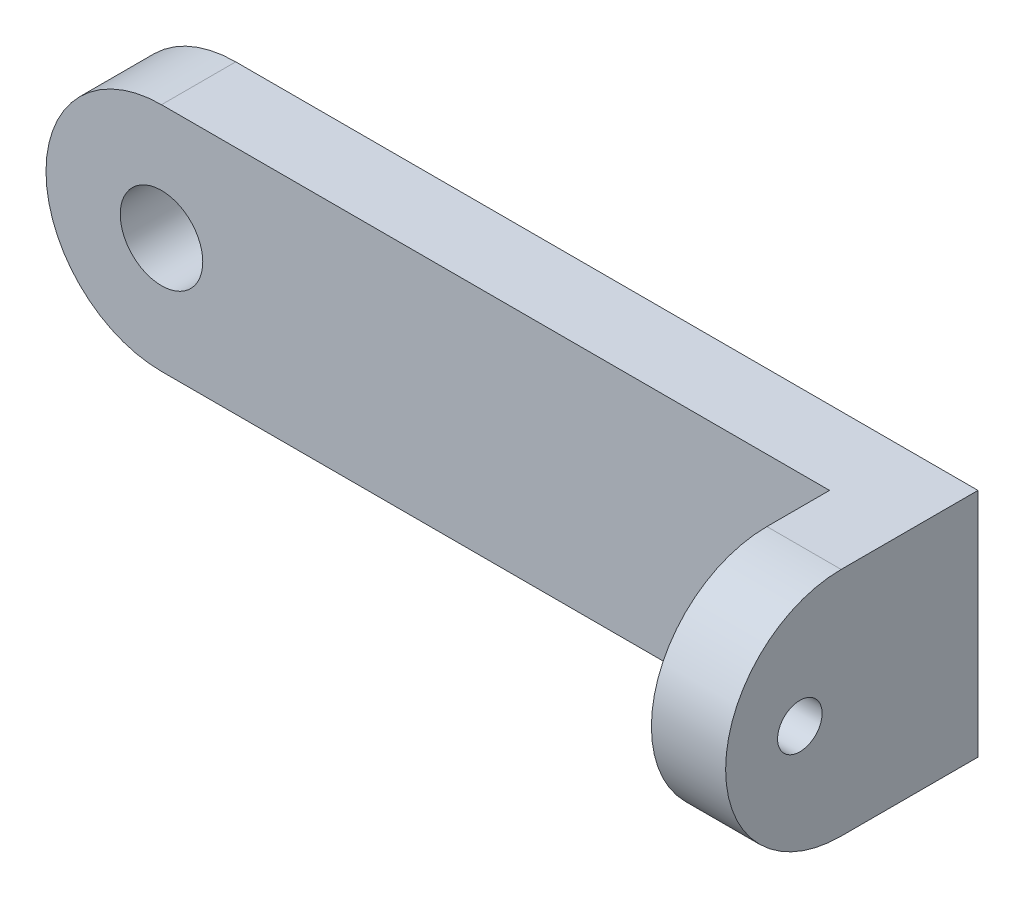
ISO-10303-21;
HEADER;
FILE_DESCRIPTION(('STEP AP214'),'2;1');
FILE_NAME('part.step','',(''),(''),'','','');
FILE_SCHEMA(('AUTOMOTIVE_DESIGN { 1 0 10303 214 1 1 1 1 }'));
ENDSEC;
DATA;
#1=APPLICATION_CONTEXT('core data for automotive mechanical design processes');
#2=APPLICATION_PROTOCOL_DEFINITION('international standard','automotive_design',2000,#1);
#3=PRODUCT_CONTEXT('',#1,'mechanical');
#4=PRODUCT('Part','Part','',(#3));
#5=PRODUCT_RELATED_PRODUCT_CATEGORY('part','',(#4));
#6=PRODUCT_DEFINITION_FORMATION('','',#4);
#7=PRODUCT_DEFINITION_CONTEXT('part definition',#1,'design');
#8=PRODUCT_DEFINITION('design','',#6,#7);
#9=PRODUCT_DEFINITION_SHAPE('','',#8);
#10=(LENGTH_UNIT() NAMED_UNIT(*) SI_UNIT(.MILLI.,.METRE.));
#11=(NAMED_UNIT(*) PLANE_ANGLE_UNIT() SI_UNIT($,.RADIAN.));
#12=(NAMED_UNIT(*) SI_UNIT($,.STERADIAN.) SOLID_ANGLE_UNIT());
#13=UNCERTAINTY_MEASURE_WITH_UNIT(LENGTH_MEASURE(1.E-05),#10,'distance_accuracy_value','');
#14=(GEOMETRIC_REPRESENTATION_CONTEXT(3) GLOBAL_UNCERTAINTY_ASSIGNED_CONTEXT((#13)) GLOBAL_UNIT_ASSIGNED_CONTEXT((#10,
#11,#12)) REPRESENTATION_CONTEXT('',''));
#15=CARTESIAN_POINT('',(0.,0.,0.));
#16=DIRECTION('',(0.,0.,1.));
#17=DIRECTION('',(1.,0.,0.));
#18=AXIS2_PLACEMENT_3D('',#15,#16,#17);
#19=CARTESIAN_POINT('',(50.,0.,9.22000000000001));
#20=DIRECTION('',(1.,0.,0.));
#21=DIRECTION('',(0.,0.,-1.));
#22=AXIS2_PLACEMENT_3D('',#19,#20,#21);
#23=CYLINDRICAL_SURFACE('',#22,7.77999999999999);
#24=DIRECTION('',(-1.,0.,0.));
#25=VECTOR('',#24,1.);
#26=CARTESIAN_POINT('',(50.,-7.77999999999999,9.22000000000001));
#27=LINE('',#26,#25);
#28=CARTESIAN_POINT('',(50.,-7.77999999999999,9.22000000000001));
#29=VERTEX_POINT('',#28);
#30=CARTESIAN_POINT('',(45.,-7.77999999999999,9.22000000000001));
#31=VERTEX_POINT('',#30);
#32=EDGE_CURVE('E89',#29,#31,#27,.T.);
#33=ORIENTED_EDGE('',*,*,#32,.F.);
#34=CARTESIAN_POINT('',(50.,0.,9.22000000000001));
#35=DIRECTION('',(1.,0.,0.));
#36=DIRECTION('',(0.,0.,-1.));
#37=AXIS2_PLACEMENT_3D('',#34,#35,#36);
#38=CIRCLE('',#37,7.77999999999999);
#39=CARTESIAN_POINT('',(50.,7.77999999999999,9.22000000000001));
#40=VERTEX_POINT('',#39);
#41=EDGE_CURVE('E42',#40,#29,#38,.T.);
#42=ORIENTED_EDGE('',*,*,#41,.F.);
#43=DIRECTION('',(-1.,0.,0.));
#44=VECTOR('',#43,1.);
#45=CARTESIAN_POINT('',(50.,7.77999999999999,9.22000000000001));
#46=LINE('',#45,#44);
#47=CARTESIAN_POINT('',(45.,7.77999999999999,9.22000000000001));
#48=VERTEX_POINT('',#47);
#49=EDGE_CURVE('E155',#48,#40,#46,.F.);
#50=ORIENTED_EDGE('',*,*,#49,.F.);
#51=CARTESIAN_POINT('',(45.,0.,9.22000000000001));
#52=DIRECTION('',(1.,0.,0.));
#53=DIRECTION('',(0.,0.,-1.));
#54=AXIS2_PLACEMENT_3D('',#51,#52,#53);
#55=CIRCLE('',#54,7.77999999999999);
#56=EDGE_CURVE('E11',#31,#48,#55,.F.);
#57=ORIENTED_EDGE('',*,*,#56,.F.);
#58=EDGE_LOOP('',(#33,#42,#50,#57));
#59=FACE_BOUND('',#58,.T.);
#60=ADVANCED_FACE('F35',(#59),#23,.T.);
#61=CARTESIAN_POINT('',(0.,0.,5.));
#62=DIRECTION('',(0.,0.,-1.));
#63=DIRECTION('',(-1.,0.,0.));
#64=AXIS2_PLACEMENT_3D('',#61,#62,#63);
#65=CYLINDRICAL_SURFACE('',#64,7.78);
#66=CARTESIAN_POINT('',(0.,0.,0.));
#67=DIRECTION('',(0.,0.,1.));
#68=DIRECTION('',(1.,0.,0.));
#69=AXIS2_PLACEMENT_3D('',#66,#67,#68);
#70=CIRCLE('',#69,7.78);
#71=CARTESIAN_POINT('',(0.,7.78,0.));
#72=VERTEX_POINT('',#71);
#73=CARTESIAN_POINT('',(0.,-7.78,0.));
#74=VERTEX_POINT('',#73);
#75=EDGE_CURVE('E146',#72,#74,#70,.T.);
#76=ORIENTED_EDGE('',*,*,#75,.T.);
#77=DIRECTION('',(0.,0.,-1.));
#78=VECTOR('',#77,1.);
#79=CARTESIAN_POINT('',(0.,-7.78,5.));
#80=LINE('',#79,#78);
#81=CARTESIAN_POINT('',(0.,-7.78,5.));
#82=VERTEX_POINT('',#81);
#83=EDGE_CURVE('E130',#82,#74,#80,.T.);
#84=ORIENTED_EDGE('',*,*,#83,.F.);
#85=CARTESIAN_POINT('',(0.,0.,5.));
#86=DIRECTION('',(0.,0.,1.));
#87=DIRECTION('',(1.,0.,0.));
#88=AXIS2_PLACEMENT_3D('',#85,#86,#87);
#89=CIRCLE('',#88,7.78);
#90=CARTESIAN_POINT('',(0.,7.78,5.));
#91=VERTEX_POINT('',#90);
#92=EDGE_CURVE('E101',#91,#82,#89,.T.);
#93=ORIENTED_EDGE('',*,*,#92,.F.);
#94=DIRECTION('',(0.,0.,-1.));
#95=VECTOR('',#94,1.);
#96=CARTESIAN_POINT('',(0.,7.78,5.));
#97=LINE('',#96,#95);
#98=EDGE_CURVE('E136',#91,#72,#97,.T.);
#99=ORIENTED_EDGE('',*,*,#98,.T.);
#100=EDGE_LOOP('',(#76,#84,#93,#99));
#101=FACE_BOUND('',#100,.T.);
#102=ADVANCED_FACE('F169',(#101),#65,.T.);
#103=CARTESIAN_POINT('',(0.,-7.78,5.));
#104=DIRECTION('',(0.,-1.,0.));
#105=DIRECTION('',(1.,0.,0.));
#106=AXIS2_PLACEMENT_3D('',#103,#104,#105);
#107=PLANE('',#106);
#108=DIRECTION('',(0.,0.,-1.));
#109=VECTOR('',#108,1.);
#110=CARTESIAN_POINT('',(50.,-7.77999999999999,5.));
#111=LINE('',#110,#109);
#112=CARTESIAN_POINT('',(50.,-7.77999999999999,0.));
#113=VERTEX_POINT('',#112);
#114=EDGE_CURVE('E132',#29,#113,#111,.T.);
#115=ORIENTED_EDGE('',*,*,#114,.F.);
#116=ORIENTED_EDGE('',*,*,#32,.T.);
#117=DIRECTION('',(0.,0.,-1.));
#118=VECTOR('',#117,1.);
#119=CARTESIAN_POINT('',(45.,-7.77999999999999,17.));
#120=LINE('',#119,#118);
#121=CARTESIAN_POINT('',(45.,-7.77999999999999,5.));
#122=VERTEX_POINT('',#121);
#123=EDGE_CURVE('E83',#31,#122,#120,.T.);
#124=ORIENTED_EDGE('',*,*,#123,.T.);
#125=DIRECTION('',(-1.,0.,0.));
#126=VECTOR('',#125,1.);
#127=CARTESIAN_POINT('',(0.,-7.78,5.));
#128=LINE('',#127,#126);
#129=EDGE_CURVE('E87',#122,#82,#128,.T.);
#130=ORIENTED_EDGE('',*,*,#129,.T.);
#131=ORIENTED_EDGE('',*,*,#83,.T.);
#132=DIRECTION('',(-1.,0.,0.));
#133=VECTOR('',#132,1.);
#134=CARTESIAN_POINT('',(0.,-7.78,0.));
#135=LINE('',#134,#133);
#136=EDGE_CURVE('E143',#113,#74,#135,.T.);
#137=ORIENTED_EDGE('',*,*,#136,.F.);
#138=EDGE_LOOP('',(#115,#116,#124,#130,#131,#137));
#139=FACE_BOUND('',#138,.T.);
#140=ADVANCED_FACE('F86',(#139),#107,.T.);
#141=CARTESIAN_POINT('',(50.,0.,5.));
#142=DIRECTION('',(1.,0.,0.));
#143=DIRECTION('',(0.,0.,-1.));
#144=AXIS2_PLACEMENT_3D('',#141,#142,#143);
#145=PLANE('',#144);
#146=CARTESIAN_POINT('',(50.,0.0299999999999927,12.));
#147=DIRECTION('',(-1.,0.,0.));
#148=DIRECTION('',(0.,0.,1.));
#149=AXIS2_PLACEMENT_3D('',#146,#147,#148);
#150=CIRCLE('',#149,1.5);
#151=CARTESIAN_POINT('',(50.,0.0299999999999927,13.5));
#152=VERTEX_POINT('',#151);
#153=EDGE_CURVE('E107',#152,#152,#150,.T.);
#154=ORIENTED_EDGE('',*,*,#153,.T.);
#155=EDGE_LOOP('',(#154));
#156=FACE_BOUND('',#155,.T.);
#157=DIRECTION('',(0.,0.,-1.));
#158=VECTOR('',#157,1.);
#159=CARTESIAN_POINT('',(50.,7.77999999999999,5.));
#160=LINE('',#159,#158);
#161=CARTESIAN_POINT('',(50.,7.77999999999999,0.));
#162=VERTEX_POINT('',#161);
#163=EDGE_CURVE('E134',#40,#162,#160,.T.);
#164=ORIENTED_EDGE('',*,*,#163,.F.);
#165=ORIENTED_EDGE('',*,*,#41,.T.);
#166=ORIENTED_EDGE('',*,*,#114,.T.);
#167=DIRECTION('',(0.,-1.,0.));
#168=VECTOR('',#167,1.);
#169=CARTESIAN_POINT('',(50.,0.,0.));
#170=LINE('',#169,#168);
#171=EDGE_CURVE('E140',#162,#113,#170,.T.);
#172=ORIENTED_EDGE('',*,*,#171,.F.);
#173=EDGE_LOOP('',(#164,#165,#166,#172));
#174=FACE_BOUND('',#173,.T.);
#175=ADVANCED_FACE('F159',(#156,#174),#145,.T.);
#176=CARTESIAN_POINT('',(0.,0.,5.));
#177=DIRECTION('',(0.,0.,-1.));
#178=DIRECTION('',(-1.,0.,0.));
#179=AXIS2_PLACEMENT_3D('',#176,#177,#178);
#180=CYLINDRICAL_SURFACE('',#179,2.78);
#181=CARTESIAN_POINT('',(0.,0.,5.));
#182=DIRECTION('',(0.,0.,1.));
#183=DIRECTION('',(1.,0.,0.));
#184=AXIS2_PLACEMENT_3D('',#181,#182,#183);
#185=CIRCLE('',#184,2.78);
#186=CARTESIAN_POINT('',(2.78,0.,5.));
#187=VERTEX_POINT('',#186);
#188=EDGE_CURVE('E121',#187,#187,#185,.T.);
#189=ORIENTED_EDGE('',*,*,#188,.T.);
#190=EDGE_LOOP('',(#189));
#191=FACE_BOUND('',#190,.T.);
#192=CARTESIAN_POINT('',(0.,0.,0.));
#193=DIRECTION('',(0.,0.,1.));
#194=DIRECTION('',(1.,0.,0.));
#195=AXIS2_PLACEMENT_3D('',#192,#193,#194);
#196=CIRCLE('',#195,2.78);
#197=CARTESIAN_POINT('',(2.78,0.,0.));
#198=VERTEX_POINT('',#197);
#199=EDGE_CURVE('E148',#198,#198,#196,.T.);
#200=ORIENTED_EDGE('',*,*,#199,.F.);
#201=EDGE_LOOP('',(#200));
#202=FACE_BOUND('',#201,.T.);
#203=ADVANCED_FACE('F178',(#191,#202),#180,.F.);
#204=CARTESIAN_POINT('',(0.,7.78,5.));
#205=DIRECTION('',(0.,1.,0.));
#206=DIRECTION('',(-1.,0.,0.));
#207=AXIS2_PLACEMENT_3D('',#204,#205,#206);
#208=PLANE('',#207);
#209=DIRECTION('',(0.,0.,-1.));
#210=VECTOR('',#209,1.);
#211=CARTESIAN_POINT('',(45.,7.77999999999999,17.));
#212=LINE('',#211,#210);
#213=CARTESIAN_POINT('',(45.,7.77999999999999,5.));
#214=VERTEX_POINT('',#213);
#215=EDGE_CURVE('E91',#48,#214,#212,.T.);
#216=ORIENTED_EDGE('',*,*,#215,.F.);
#217=ORIENTED_EDGE('',*,*,#49,.T.);
#218=ORIENTED_EDGE('',*,*,#163,.T.);
#219=DIRECTION('',(1.,0.,0.));
#220=VECTOR('',#219,1.);
#221=CARTESIAN_POINT('',(0.,7.78,0.));
#222=LINE('',#221,#220);
#223=EDGE_CURVE('E124',#72,#162,#222,.T.);
#224=ORIENTED_EDGE('',*,*,#223,.F.);
#225=ORIENTED_EDGE('',*,*,#98,.F.);
#226=DIRECTION('',(1.,0.,0.));
#227=VECTOR('',#226,1.);
#228=CARTESIAN_POINT('',(0.,7.78,5.));
#229=LINE('',#228,#227);
#230=EDGE_CURVE('E103',#91,#214,#229,.T.);
#231=ORIENTED_EDGE('',*,*,#230,.T.);
#232=EDGE_LOOP('',(#216,#217,#218,#224,#225,#231));
#233=FACE_BOUND('',#232,.T.);
#234=ADVANCED_FACE('F167',(#233),#208,.T.);
#235=CARTESIAN_POINT('',(0.,0.,5.));
#236=DIRECTION('',(0.,0.,1.));
#237=DIRECTION('',(1.,0.,0.));
#238=AXIS2_PLACEMENT_3D('',#235,#236,#237);
#239=PLANE('',#238);
#240=DIRECTION('',(0.,-1.,0.));
#241=VECTOR('',#240,1.);
#242=CARTESIAN_POINT('',(45.,7.77999999999999,5.));
#243=LINE('',#242,#241);
#244=EDGE_CURVE('E92',#214,#122,#243,.T.);
#245=ORIENTED_EDGE('',*,*,#244,.F.);
#246=ORIENTED_EDGE('',*,*,#230,.F.);
#247=ORIENTED_EDGE('',*,*,#92,.T.);
#248=ORIENTED_EDGE('',*,*,#129,.F.);
#249=EDGE_LOOP('',(#245,#246,#247,#248));
#250=FACE_BOUND('',#249,.T.);
#251=ORIENTED_EDGE('',*,*,#188,.F.);
#252=EDGE_LOOP('',(#251));
#253=FACE_BOUND('',#252,.T.);
#254=ADVANCED_FACE('F96',(#250,#253),#239,.T.);
#255=CARTESIAN_POINT('',(0.,0.,0.));
#256=DIRECTION('',(0.,0.,1.));
#257=DIRECTION('',(1.,0.,0.));
#258=AXIS2_PLACEMENT_3D('',#255,#256,#257);
#259=PLANE('',#258);
#260=ORIENTED_EDGE('',*,*,#199,.T.);
#261=EDGE_LOOP('',(#260));
#262=FACE_BOUND('',#261,.T.);
#263=ORIENTED_EDGE('',*,*,#75,.F.);
#264=ORIENTED_EDGE('',*,*,#223,.T.);
#265=ORIENTED_EDGE('',*,*,#171,.T.);
#266=ORIENTED_EDGE('',*,*,#136,.T.);
#267=EDGE_LOOP('',(#263,#264,#265,#266));
#268=FACE_BOUND('',#267,.T.);
#269=ADVANCED_FACE('F164',(#262,#268),#259,.F.);
#270=CARTESIAN_POINT('',(45.,7.77999999999999,17.));
#271=DIRECTION('',(1.,0.,0.));
#272=DIRECTION('',(0.,0.,-1.));
#273=AXIS2_PLACEMENT_3D('',#270,#271,#272);
#274=PLANE('',#273);
#275=CARTESIAN_POINT('',(45.,0.0299999999999927,12.));
#276=DIRECTION('',(-1.,0.,0.));
#277=DIRECTION('',(0.,0.,1.));
#278=AXIS2_PLACEMENT_3D('',#275,#276,#277);
#279=CIRCLE('',#278,1.5);
#280=CARTESIAN_POINT('',(45.,0.0299999999999927,13.5));
#281=VERTEX_POINT('',#280);
#282=EDGE_CURVE('E110',#281,#281,#279,.T.);
#283=ORIENTED_EDGE('',*,*,#282,.F.);
#284=EDGE_LOOP('',(#283));
#285=FACE_BOUND('',#284,.T.);
#286=ORIENTED_EDGE('',*,*,#123,.F.);
#287=ORIENTED_EDGE('',*,*,#56,.T.);
#288=ORIENTED_EDGE('',*,*,#215,.T.);
#289=ORIENTED_EDGE('',*,*,#244,.T.);
#290=EDGE_LOOP('',(#286,#287,#288,#289));
#291=FACE_BOUND('',#290,.T.);
#292=ADVANCED_FACE('F105',(#285,#291),#274,.F.);
#293=CARTESIAN_POINT('',(45.,0.0299999999999927,12.));
#294=DIRECTION('',(-1.,0.,0.));
#295=DIRECTION('',(0.,0.,1.));
#296=AXIS2_PLACEMENT_3D('',#293,#294,#295);
#297=CYLINDRICAL_SURFACE('',#296,1.5);
#298=ORIENTED_EDGE('',*,*,#153,.F.);
#299=EDGE_LOOP('',(#298));
#300=FACE_BOUND('',#299,.T.);
#301=ORIENTED_EDGE('',*,*,#282,.T.);
#302=EDGE_LOOP('',(#301));
#303=FACE_BOUND('',#302,.T.);
#304=ADVANCED_FACE('F198',(#300,#303),#297,.F.);
#305=CLOSED_SHELL('',(#60,#102,#140,#175,#203,#234,#254,#269,#292,#304));
#306=MANIFOLD_SOLID_BREP('B2',#305);
#307=ADVANCED_BREP_SHAPE_REPRESENTATION('',(#18,#306),#14);
#308=SHAPE_DEFINITION_REPRESENTATION(#9,#307);
ENDSEC;
END-ISO-10303-21;
